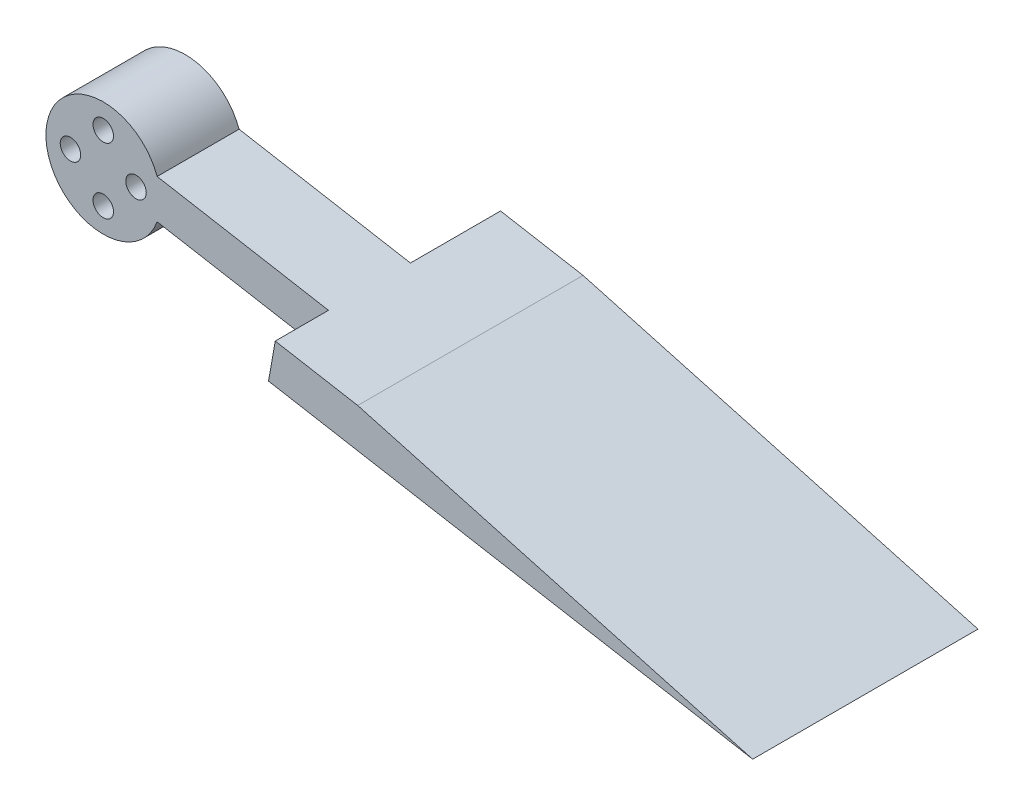
ISO-10303-21;
HEADER;
FILE_DESCRIPTION(('STEP AP214'),'2;1');
FILE_NAME('part.step','',(''),(''),'','','');
FILE_SCHEMA(('AUTOMOTIVE_DESIGN { 1 0 10303 214 1 1 1 1 }'));
ENDSEC;
DATA;
#1=APPLICATION_CONTEXT('core data for automotive mechanical design processes');
#2=APPLICATION_PROTOCOL_DEFINITION('international standard','automotive_design',2000,#1);
#3=PRODUCT_CONTEXT('',#1,'mechanical');
#4=PRODUCT('Part','Part','',(#3));
#5=PRODUCT_RELATED_PRODUCT_CATEGORY('part','',(#4));
#6=PRODUCT_DEFINITION_FORMATION('','',#4);
#7=PRODUCT_DEFINITION_CONTEXT('part definition',#1,'design');
#8=PRODUCT_DEFINITION('design','',#6,#7);
#9=PRODUCT_DEFINITION_SHAPE('','',#8);
#10=(LENGTH_UNIT() NAMED_UNIT(*) SI_UNIT(.MILLI.,.METRE.));
#11=(NAMED_UNIT(*) PLANE_ANGLE_UNIT() SI_UNIT($,.RADIAN.));
#12=(NAMED_UNIT(*) SI_UNIT($,.STERADIAN.) SOLID_ANGLE_UNIT());
#13=UNCERTAINTY_MEASURE_WITH_UNIT(LENGTH_MEASURE(1.E-05),#10,'distance_accuracy_value','');
#14=(GEOMETRIC_REPRESENTATION_CONTEXT(3) GLOBAL_UNCERTAINTY_ASSIGNED_CONTEXT((#13)) GLOBAL_UNIT_ASSIGNED_CONTEXT((#10,
#11,#12)) REPRESENTATION_CONTEXT('',''));
#15=CARTESIAN_POINT('',(0.,0.,0.));
#16=DIRECTION('',(0.,0.,1.));
#17=DIRECTION('',(1.,0.,0.));
#18=AXIS2_PLACEMENT_3D('',#15,#16,#17);
#19=CARTESIAN_POINT('',(0.,0.,-10.));
#20=DIRECTION('',(0.,0.,1.));
#21=DIRECTION('',(-1.,0.,0.));
#22=AXIS2_PLACEMENT_3D('',#19,#20,#21);
#23=CYLINDRICAL_SURFACE('',#22,7.);
#24=CARTESIAN_POINT('',(0.,0.,0.));
#25=DIRECTION('',(0.,0.,1.));
#26=DIRECTION('',(1.,0.,0.));
#27=AXIS2_PLACEMENT_3D('',#24,#25,#26);
#28=CIRCLE('',#27,7.);
#29=CARTESIAN_POINT('',(6.57784834550136,2.39414100327969,0.));
#30=VERTEX_POINT('',#29);
#31=CARTESIAN_POINT('',(6.57784834550136,-2.39414100327969,0.));
#32=VERTEX_POINT('',#31);
#33=EDGE_CURVE('E142',#30,#32,#28,.T.);
#34=ORIENTED_EDGE('',*,*,#33,.F.);
#35=DIRECTION('',(0.,0.,1.));
#36=VECTOR('',#35,1.);
#37=CARTESIAN_POINT('',(6.57784834550136,2.39414100327969,-10.));
#38=LINE('',#37,#36);
#39=CARTESIAN_POINT('',(6.57784834550136,2.39414100327969,-10.));
#40=VERTEX_POINT('',#39);
#41=EDGE_CURVE('E152',#40,#30,#38,.T.);
#42=ORIENTED_EDGE('',*,*,#41,.F.);
#43=CARTESIAN_POINT('',(0.,0.,-10.));
#44=DIRECTION('',(0.,0.,1.));
#45=DIRECTION('',(1.,0.,0.));
#46=AXIS2_PLACEMENT_3D('',#43,#44,#45);
#47=CIRCLE('',#46,7.);
#48=CARTESIAN_POINT('',(6.57784834550136,-2.39414100327969,-10.));
#49=VERTEX_POINT('',#48);
#50=EDGE_CURVE('E143',#40,#49,#47,.T.);
#51=ORIENTED_EDGE('',*,*,#50,.T.);
#52=DIRECTION('',(0.,0.,1.));
#53=VECTOR('',#52,1.);
#54=CARTESIAN_POINT('',(6.57784834550136,-2.39414100327969,-10.));
#55=LINE('',#54,#53);
#56=EDGE_CURVE('E47',#49,#32,#55,.T.);
#57=ORIENTED_EDGE('',*,*,#56,.T.);
#58=EDGE_LOOP('',(#34,#42,#51,#57));
#59=FACE_BOUND('',#58,.T.);
#60=ADVANCED_FACE('F39',(#59),#23,.T.);
#61=CARTESIAN_POINT('',(85.7590038964178,-16.3559150905801,-10.));
#62=DIRECTION('',(0.173648177666931,0.984807753012208,0.));
#63=DIRECTION('',(-0.984807753012208,0.173648177666931,0.));
#64=AXIS2_PLACEMENT_3D('',#61,#62,#63);
#65=PLANE('',#64);
#66=DIRECTION('',(0.984807753012208,-0.173648177666931,0.));
#67=VECTOR('',#66,1.);
#68=CARTESIAN_POINT('',(85.7590038964178,-16.3559150905801,0.));
#69=LINE('',#68,#67);
#70=CARTESIAN_POINT('',(26.6705387156853,-5.93702443056427,0.));
#71=VERTEX_POINT('',#70);
#72=EDGE_CURVE('E155',#32,#71,#69,.T.);
#73=ORIENTED_EDGE('',*,*,#72,.F.);
#74=ORIENTED_EDGE('',*,*,#56,.F.);
#75=DIRECTION('',(0.984807753012208,-0.173648177666931,0.));
#76=VECTOR('',#75,1.);
#77=CARTESIAN_POINT('',(85.7590038964178,-16.3559150905801,-10.));
#78=LINE('',#77,#76);
#79=CARTESIAN_POINT('',(26.6705387156853,-5.93702443056427,-10.));
#80=VERTEX_POINT('',#79);
#81=EDGE_CURVE('E146',#49,#80,#78,.T.);
#82=ORIENTED_EDGE('',*,*,#81,.T.);
#83=DIRECTION('',(0.,0.,-1.));
#84=VECTOR('',#83,1.);
#85=CARTESIAN_POINT('',(26.6705387156853,-5.93702443056427,6.5));
#86=LINE('',#85,#84);
#87=CARTESIAN_POINT('',(26.6705387156853,-5.93702443056427,-21.));
#88=VERTEX_POINT('',#87);
#89=EDGE_CURVE('E139',#80,#88,#86,.T.);
#90=ORIENTED_EDGE('',*,*,#89,.T.);
#91=DIRECTION('',(0.984807753012208,-0.17364817766693,0.));
#92=VECTOR('',#91,1.);
#93=CARTESIAN_POINT('',(26.6705387156853,-5.93702443056427,-21.));
#94=LINE('',#93,#92);
#95=CARTESIAN_POINT('',(85.7590038964178,-16.3559150905801,-21.));
#96=VERTEX_POINT('',#95);
#97=EDGE_CURVE('E126',#88,#96,#94,.T.);
#98=ORIENTED_EDGE('',*,*,#97,.T.);
#99=DIRECTION('',(0.,0.,1.));
#100=VECTOR('',#99,1.);
#101=CARTESIAN_POINT('',(85.7590038964178,-16.3559150905801,-10.));
#102=LINE('',#101,#100);
#103=CARTESIAN_POINT('',(85.7590038964178,-16.3559150905801,6.5));
#104=VERTEX_POINT('',#103);
#105=EDGE_CURVE('E161',#96,#104,#102,.T.);
#106=ORIENTED_EDGE('',*,*,#105,.T.);
#107=DIRECTION('',(0.984807753012208,-0.17364817766693,0.));
#108=VECTOR('',#107,1.);
#109=CARTESIAN_POINT('',(26.6705387156853,-5.93702443056427,6.5));
#110=LINE('',#109,#108);
#111=CARTESIAN_POINT('',(26.6705387156853,-5.93702443056427,6.5));
#112=VERTEX_POINT('',#111);
#113=EDGE_CURVE('E111',#112,#104,#110,.T.);
#114=ORIENTED_EDGE('',*,*,#113,.F.);
#115=EDGE_CURVE('E136',#112,#71,#86,.T.);
#116=ORIENTED_EDGE('',*,*,#115,.T.);
#117=EDGE_LOOP('',(#73,#74,#82,#90,#98,#106,#114,#116));
#118=FACE_BOUND('',#117,.T.);
#119=ADVANCED_FACE('F199',(#118),#65,.F.);
#120=CARTESIAN_POINT('',(6.57784834550136,2.39414100327969,-10.));
#121=DIRECTION('',(-0.173648177666931,-0.984807753012208,0.));
#122=DIRECTION('',(0.984807753012208,-0.173648177666931,0.));
#123=AXIS2_PLACEMENT_3D('',#120,#121,#122);
#124=PLANE('',#123);
#125=DIRECTION('',(-0.984807753012208,0.17364817766693,0.));
#126=VECTOR('',#125,1.);
#127=CARTESIAN_POINT('',(86.5778483455014,-11.7120174533975,-21.));
#128=LINE('',#127,#126);
#129=CARTESIAN_POINT('',(37.556934536008,-3.06830772979965,-21.));
#130=VERTEX_POINT('',#129);
#131=CARTESIAN_POINT('',(27.4893831647689,-1.2931267933817,-21.));
#132=VERTEX_POINT('',#131);
#133=EDGE_CURVE('E119',#130,#132,#128,.T.);
#134=ORIENTED_EDGE('',*,*,#133,.T.);
#135=DIRECTION('',(0.,0.,-1.));
#136=VECTOR('',#135,1.);
#137=CARTESIAN_POINT('',(27.4893831647689,-1.2931267933817,6.5));
#138=LINE('',#137,#136);
#139=CARTESIAN_POINT('',(27.4893831647689,-1.2931267933817,-10.));
#140=VERTEX_POINT('',#139);
#141=EDGE_CURVE('E135',#140,#132,#138,.T.);
#142=ORIENTED_EDGE('',*,*,#141,.F.);
#143=DIRECTION('',(-0.984807753012208,0.173648177666931,0.));
#144=VECTOR('',#143,1.);
#145=CARTESIAN_POINT('',(6.57784834550136,2.39414100327969,-10.));
#146=LINE('',#145,#144);
#147=EDGE_CURVE('E150',#140,#40,#146,.T.);
#148=ORIENTED_EDGE('',*,*,#147,.T.);
#149=ORIENTED_EDGE('',*,*,#41,.T.);
#150=DIRECTION('',(-0.984807753012208,0.173648177666931,0.));
#151=VECTOR('',#150,1.);
#152=CARTESIAN_POINT('',(6.57784834550136,2.39414100327969,0.));
#153=LINE('',#152,#151);
#154=CARTESIAN_POINT('',(27.4893831647689,-1.2931267933817,0.));
#155=VERTEX_POINT('',#154);
#156=EDGE_CURVE('E147',#155,#30,#153,.T.);
#157=ORIENTED_EDGE('',*,*,#156,.F.);
#158=CARTESIAN_POINT('',(27.4893831647689,-1.2931267933817,6.5));
#159=VERTEX_POINT('',#158);
#160=EDGE_CURVE('E124',#159,#155,#138,.T.);
#161=ORIENTED_EDGE('',*,*,#160,.F.);
#162=DIRECTION('',(-0.984807753012208,0.17364817766693,0.));
#163=VECTOR('',#162,1.);
#164=CARTESIAN_POINT('',(86.5778483455014,-11.7120174533975,6.5));
#165=LINE('',#164,#163);
#166=CARTESIAN_POINT('',(37.5569345360082,-3.0683077297997,6.5));
#167=VERTEX_POINT('',#166);
#168=EDGE_CURVE('E108',#167,#159,#165,.T.);
#169=ORIENTED_EDGE('',*,*,#168,.F.);
#170=DIRECTION('',(0.,0.,-1.));
#171=VECTOR('',#170,1.);
#172=CARTESIAN_POINT('',(37.5569345360082,-3.0683077297997,6.5));
#173=LINE('',#172,#171);
#174=EDGE_CURVE('E113',#167,#130,#173,.T.);
#175=ORIENTED_EDGE('',*,*,#174,.T.);
#176=EDGE_LOOP('',(#134,#142,#148,#149,#157,#161,#169,#175));
#177=FACE_BOUND('',#176,.T.);
#178=ADVANCED_FACE('F121',(#177),#124,.F.);
#179=CARTESIAN_POINT('',(0.,0.,-10.));
#180=DIRECTION('',(0.,0.,-1.));
#181=DIRECTION('',(1.,0.,0.));
#182=AXIS2_PLACEMENT_3D('',#179,#180,#181);
#183=PLANE('',#182);
#184=CARTESIAN_POINT('',(0.,4.,-10.));
#185=DIRECTION('',(0.,0.,1.));
#186=DIRECTION('',(1.,0.,0.));
#187=AXIS2_PLACEMENT_3D('',#184,#185,#186);
#188=CIRCLE('',#187,1.24999999999999);
#189=CARTESIAN_POINT('',(1.24999999999999,4.,-10.));
#190=VERTEX_POINT('',#189);
#191=EDGE_CURVE('E184',#190,#190,#188,.T.);
#192=ORIENTED_EDGE('',*,*,#191,.T.);
#193=EDGE_LOOP('',(#192));
#194=FACE_BOUND('',#193,.T.);
#195=CARTESIAN_POINT('',(4.,0.,-10.));
#196=DIRECTION('',(0.,0.,1.));
#197=DIRECTION('',(1.,0.,0.));
#198=AXIS2_PLACEMENT_3D('',#195,#196,#197);
#199=CIRCLE('',#198,1.24999999999999);
#200=CARTESIAN_POINT('',(5.24999999999999,0.,-10.));
#201=VERTEX_POINT('',#200);
#202=EDGE_CURVE('E174',#201,#201,#199,.T.);
#203=ORIENTED_EDGE('',*,*,#202,.T.);
#204=EDGE_LOOP('',(#203));
#205=FACE_BOUND('',#204,.T.);
#206=CARTESIAN_POINT('',(0.,-4.,-10.));
#207=DIRECTION('',(0.,0.,1.));
#208=DIRECTION('',(1.,0.,0.));
#209=AXIS2_PLACEMENT_3D('',#206,#207,#208);
#210=CIRCLE('',#209,1.24999999999999);
#211=CARTESIAN_POINT('',(1.24999999999999,-4.,-10.));
#212=VERTEX_POINT('',#211);
#213=EDGE_CURVE('E171',#212,#212,#210,.T.);
#214=ORIENTED_EDGE('',*,*,#213,.T.);
#215=EDGE_LOOP('',(#214));
#216=FACE_BOUND('',#215,.T.);
#217=CARTESIAN_POINT('',(-4.,0.,-10.));
#218=DIRECTION('',(0.,0.,1.));
#219=DIRECTION('',(1.,0.,0.));
#220=AXIS2_PLACEMENT_3D('',#217,#218,#219);
#221=CIRCLE('',#220,1.24999999999999);
#222=CARTESIAN_POINT('',(-2.75000000000001,0.,-10.));
#223=VERTEX_POINT('',#222);
#224=EDGE_CURVE('E168',#223,#223,#221,.T.);
#225=ORIENTED_EDGE('',*,*,#224,.T.);
#226=EDGE_LOOP('',(#225));
#227=FACE_BOUND('',#226,.T.);
#228=DIRECTION('',(-0.173648177666931,-0.984807753012208,0.));
#229=VECTOR('',#228,1.);
#230=CARTESIAN_POINT('',(26.8816145429346,-4.73995392892443,-10.));
#231=LINE('',#230,#229);
#232=EDGE_CURVE('E63',#140,#80,#231,.T.);
#233=ORIENTED_EDGE('',*,*,#232,.T.);
#234=ORIENTED_EDGE('',*,*,#81,.F.);
#235=ORIENTED_EDGE('',*,*,#50,.F.);
#236=ORIENTED_EDGE('',*,*,#147,.F.);
#237=EDGE_LOOP('',(#233,#234,#235,#236));
#238=FACE_BOUND('',#237,.T.);
#239=ADVANCED_FACE('F202',(#194,#205,#216,#227,#238),#183,.T.);
#240=CARTESIAN_POINT('',(0.,0.,0.));
#241=DIRECTION('',(0.,0.,-1.));
#242=DIRECTION('',(1.,0.,0.));
#243=AXIS2_PLACEMENT_3D('',#240,#241,#242);
#244=PLANE('',#243);
#245=CARTESIAN_POINT('',(0.,4.,0.));
#246=DIRECTION('',(0.,0.,1.));
#247=DIRECTION('',(1.,0.,0.));
#248=AXIS2_PLACEMENT_3D('',#245,#246,#247);
#249=CIRCLE('',#248,1.24999999999999);
#250=CARTESIAN_POINT('',(1.24999999999999,4.,0.));
#251=VERTEX_POINT('',#250);
#252=EDGE_CURVE('E42',#251,#251,#249,.T.);
#253=ORIENTED_EDGE('',*,*,#252,.F.);
#254=EDGE_LOOP('',(#253));
#255=FACE_BOUND('',#254,.T.);
#256=CARTESIAN_POINT('',(4.,0.,0.));
#257=DIRECTION('',(0.,0.,1.));
#258=DIRECTION('',(1.,0.,0.));
#259=AXIS2_PLACEMENT_3D('',#256,#257,#258);
#260=CIRCLE('',#259,1.24999999999999);
#261=CARTESIAN_POINT('',(5.24999999999999,0.,0.));
#262=VERTEX_POINT('',#261);
#263=EDGE_CURVE('E172',#262,#262,#260,.T.);
#264=ORIENTED_EDGE('',*,*,#263,.F.);
#265=EDGE_LOOP('',(#264));
#266=FACE_BOUND('',#265,.T.);
#267=CARTESIAN_POINT('',(0.,-4.,0.));
#268=DIRECTION('',(0.,0.,1.));
#269=DIRECTION('',(1.,0.,0.));
#270=AXIS2_PLACEMENT_3D('',#267,#268,#269);
#271=CIRCLE('',#270,1.24999999999999);
#272=CARTESIAN_POINT('',(1.24999999999999,-4.,0.));
#273=VERTEX_POINT('',#272);
#274=EDGE_CURVE('E169',#273,#273,#271,.T.);
#275=ORIENTED_EDGE('',*,*,#274,.F.);
#276=EDGE_LOOP('',(#275));
#277=FACE_BOUND('',#276,.T.);
#278=CARTESIAN_POINT('',(-4.,0.,0.));
#279=DIRECTION('',(0.,0.,1.));
#280=DIRECTION('',(1.,0.,0.));
#281=AXIS2_PLACEMENT_3D('',#278,#279,#280);
#282=CIRCLE('',#281,1.24999999999999);
#283=CARTESIAN_POINT('',(-2.75000000000001,0.,0.));
#284=VERTEX_POINT('',#283);
#285=EDGE_CURVE('E165',#284,#284,#282,.T.);
#286=ORIENTED_EDGE('',*,*,#285,.F.);
#287=EDGE_LOOP('',(#286));
#288=FACE_BOUND('',#287,.T.);
#289=ORIENTED_EDGE('',*,*,#156,.T.);
#290=ORIENTED_EDGE('',*,*,#33,.T.);
#291=ORIENTED_EDGE('',*,*,#72,.T.);
#292=DIRECTION('',(-0.173648177666931,-0.984807753012208,0.));
#293=VECTOR('',#292,1.);
#294=CARTESIAN_POINT('',(26.8816145429346,-4.73995392892443,0.));
#295=LINE('',#294,#293);
#296=EDGE_CURVE('E11',#155,#71,#295,.T.);
#297=ORIENTED_EDGE('',*,*,#296,.F.);
#298=EDGE_LOOP('',(#289,#290,#291,#297));
#299=FACE_BOUND('',#298,.T.);
#300=ADVANCED_FACE('F207',(#255,#266,#277,#288,#299),#244,.F.);
#301=CARTESIAN_POINT('',(0.,0.,6.5));
#302=DIRECTION('',(0.,0.,-1.));
#303=DIRECTION('',(1.,0.,0.));
#304=AXIS2_PLACEMENT_3D('',#301,#302,#303);
#305=PLANE('',#304);
#306=ORIENTED_EDGE('',*,*,#168,.T.);
#307=DIRECTION('',(-0.173648177666931,-0.984807753012208,0.));
#308=VECTOR('',#307,1.);
#309=CARTESIAN_POINT('',(27.4893831647689,-1.2931267933817,6.5));
#310=LINE('',#309,#308);
#311=EDGE_CURVE('E125',#159,#112,#310,.T.);
#312=ORIENTED_EDGE('',*,*,#311,.T.);
#313=ORIENTED_EDGE('',*,*,#113,.T.);
#314=DIRECTION('',(0.964041387208191,-0.265752147215608,0.));
#315=VECTOR('',#314,1.);
#316=CARTESIAN_POINT('',(85.7590038964178,-16.3559150905801,6.5));
#317=LINE('',#316,#315);
#318=EDGE_CURVE('E105',#167,#104,#317,.T.);
#319=ORIENTED_EDGE('',*,*,#318,.F.);
#320=EDGE_LOOP('',(#306,#312,#313,#319));
#321=FACE_BOUND('',#320,.T.);
#322=ADVANCED_FACE('F106',(#321),#305,.F.);
#323=CARTESIAN_POINT('',(27.4893831647689,-1.2931267933817,6.5));
#324=DIRECTION('',(-0.984807753012208,0.173648177666931,0.));
#325=DIRECTION('',(-0.173648177666931,-0.984807753012208,0.));
#326=AXIS2_PLACEMENT_3D('',#323,#324,#325);
#327=PLANE('',#326);
#328=ORIENTED_EDGE('',*,*,#296,.T.);
#329=ORIENTED_EDGE('',*,*,#115,.F.);
#330=ORIENTED_EDGE('',*,*,#311,.F.);
#331=ORIENTED_EDGE('',*,*,#160,.T.);
#332=EDGE_LOOP('',(#328,#329,#330,#331));
#333=FACE_BOUND('',#332,.T.);
#334=ADVANCED_FACE('F210',(#333),#327,.T.);
#335=ORIENTED_EDGE('',*,*,#141,.T.);
#336=DIRECTION('',(-0.173648177666931,-0.984807753012208,0.));
#337=VECTOR('',#336,1.);
#338=CARTESIAN_POINT('',(27.4893831647689,-1.2931267933817,-21.));
#339=LINE('',#338,#337);
#340=EDGE_CURVE('E130',#132,#88,#339,.T.);
#341=ORIENTED_EDGE('',*,*,#340,.T.);
#342=ORIENTED_EDGE('',*,*,#89,.F.);
#343=ORIENTED_EDGE('',*,*,#232,.F.);
#344=EDGE_LOOP('',(#335,#341,#342,#343));
#345=FACE_BOUND('',#344,.T.);
#346=ADVANCED_FACE('F193',(#345),#327,.T.);
#347=CARTESIAN_POINT('',(0.,0.,-21.));
#348=DIRECTION('',(0.,0.,-1.));
#349=DIRECTION('',(1.,0.,0.));
#350=AXIS2_PLACEMENT_3D('',#347,#348,#349);
#351=PLANE('',#350);
#352=DIRECTION('',(0.964041387208191,-0.265752147215608,0.));
#353=VECTOR('',#352,1.);
#354=CARTESIAN_POINT('',(85.7590038964178,-16.3559150905801,-21.));
#355=LINE('',#354,#353);
#356=EDGE_CURVE('E55',#130,#96,#355,.T.);
#357=ORIENTED_EDGE('',*,*,#356,.T.);
#358=ORIENTED_EDGE('',*,*,#97,.F.);
#359=ORIENTED_EDGE('',*,*,#340,.F.);
#360=ORIENTED_EDGE('',*,*,#133,.F.);
#361=EDGE_LOOP('',(#357,#358,#359,#360));
#362=FACE_BOUND('',#361,.T.);
#363=ADVANCED_FACE('F197',(#362),#351,.T.);
#364=CARTESIAN_POINT('',(85.7590038964178,-16.3559150905801,6.5));
#365=DIRECTION('',(-0.265752147215608,-0.964041387208191,0.));
#366=DIRECTION('',(0.964041387208191,-0.265752147215608,0.));
#367=AXIS2_PLACEMENT_3D('',#364,#365,#366);
#368=PLANE('',#367);
#369=ORIENTED_EDGE('',*,*,#356,.F.);
#370=ORIENTED_EDGE('',*,*,#174,.F.);
#371=ORIENTED_EDGE('',*,*,#318,.T.);
#372=ORIENTED_EDGE('',*,*,#105,.F.);
#373=EDGE_LOOP('',(#369,#370,#371,#372));
#374=FACE_BOUND('',#373,.T.);
#375=ADVANCED_FACE('F115',(#374),#368,.F.);
#376=CARTESIAN_POINT('',(-4.,0.,-10.));
#377=DIRECTION('',(0.,0.,-1.));
#378=DIRECTION('',(1.,0.,0.));
#379=AXIS2_PLACEMENT_3D('',#376,#377,#378);
#380=CYLINDRICAL_SURFACE('',#379,1.24999999999999);
#381=ORIENTED_EDGE('',*,*,#224,.F.);
#382=EDGE_LOOP('',(#381));
#383=FACE_BOUND('',#382,.T.);
#384=ORIENTED_EDGE('',*,*,#285,.T.);
#385=EDGE_LOOP('',(#384));
#386=FACE_BOUND('',#385,.T.);
#387=ADVANCED_FACE('F241',(#383,#386),#380,.F.);
#388=CARTESIAN_POINT('',(0.,-4.,-10.));
#389=DIRECTION('',(0.,0.,-1.));
#390=DIRECTION('',(1.,0.,0.));
#391=AXIS2_PLACEMENT_3D('',#388,#389,#390);
#392=CYLINDRICAL_SURFACE('',#391,1.24999999999999);
#393=ORIENTED_EDGE('',*,*,#213,.F.);
#394=EDGE_LOOP('',(#393));
#395=FACE_BOUND('',#394,.T.);
#396=ORIENTED_EDGE('',*,*,#274,.T.);
#397=EDGE_LOOP('',(#396));
#398=FACE_BOUND('',#397,.T.);
#399=ADVANCED_FACE('F244',(#395,#398),#392,.F.);
#400=CARTESIAN_POINT('',(4.,0.,-10.));
#401=DIRECTION('',(0.,0.,-1.));
#402=DIRECTION('',(1.,0.,0.));
#403=AXIS2_PLACEMENT_3D('',#400,#401,#402);
#404=CYLINDRICAL_SURFACE('',#403,1.24999999999999);
#405=ORIENTED_EDGE('',*,*,#202,.F.);
#406=EDGE_LOOP('',(#405));
#407=FACE_BOUND('',#406,.T.);
#408=ORIENTED_EDGE('',*,*,#263,.T.);
#409=EDGE_LOOP('',(#408));
#410=FACE_BOUND('',#409,.T.);
#411=ADVANCED_FACE('F252',(#407,#410),#404,.F.);
#412=CARTESIAN_POINT('',(0.,4.,-10.));
#413=DIRECTION('',(0.,0.,-1.));
#414=DIRECTION('',(1.,0.,0.));
#415=AXIS2_PLACEMENT_3D('',#412,#413,#414);
#416=CYLINDRICAL_SURFACE('',#415,1.24999999999999);
#417=ORIENTED_EDGE('',*,*,#191,.F.);
#418=EDGE_LOOP('',(#417));
#419=FACE_BOUND('',#418,.T.);
#420=ORIENTED_EDGE('',*,*,#252,.T.);
#421=EDGE_LOOP('',(#420));
#422=FACE_BOUND('',#421,.T.);
#423=ADVANCED_FACE('F288',(#419,#422),#416,.F.);
#424=CLOSED_SHELL('',(#60,#119,#178,#239,#300,#322,#334,#346,#363,#375,#387,#399,#411,#423));
#425=MANIFOLD_SOLID_BREP('B2',#424);
#426=ADVANCED_BREP_SHAPE_REPRESENTATION('',(#18,#425),#14);
#427=SHAPE_DEFINITION_REPRESENTATION(#9,#426);
ENDSEC;
END-ISO-10303-21;
